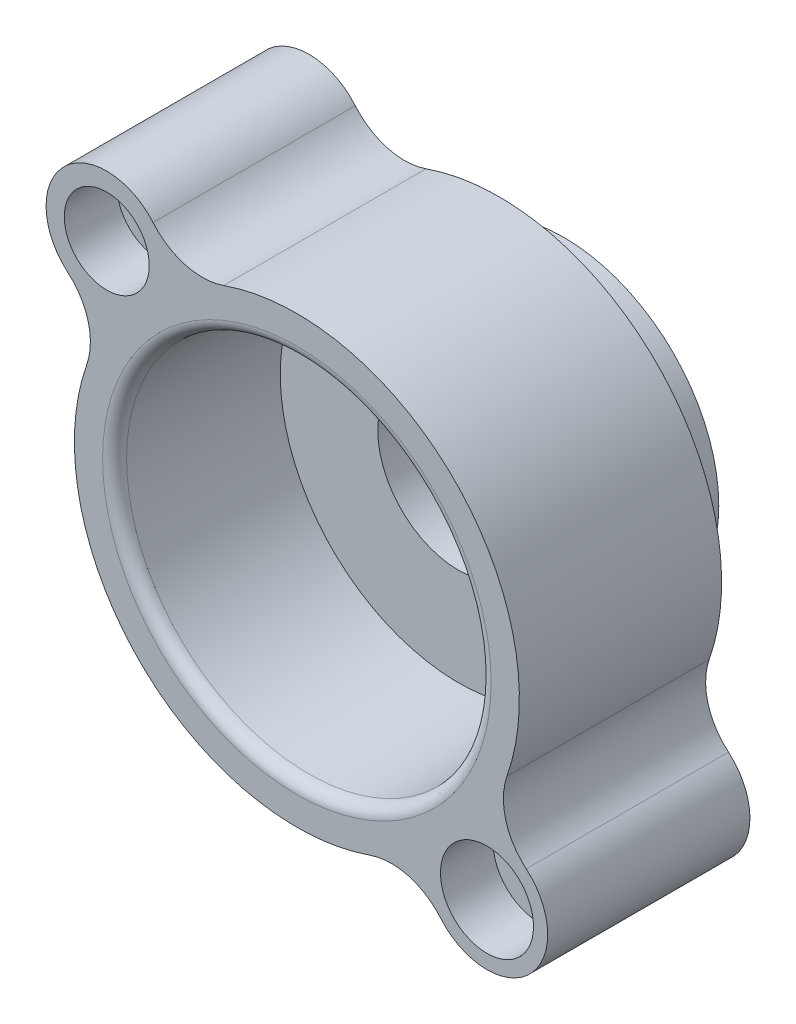
ISO-10303-21;
HEADER;
FILE_DESCRIPTION(('STEP AP214'),'2;1');
FILE_NAME('part.step','',(''),(''),'','','');
FILE_SCHEMA(('AUTOMOTIVE_DESIGN { 1 0 10303 214 1 1 1 1 }'));
ENDSEC;
DATA;
#1=APPLICATION_CONTEXT('core data for automotive mechanical design processes');
#2=APPLICATION_PROTOCOL_DEFINITION('international standard','automotive_design',2000,#1);
#3=PRODUCT_CONTEXT('',#1,'mechanical');
#4=PRODUCT('Part','Part','',(#3));
#5=PRODUCT_RELATED_PRODUCT_CATEGORY('part','',(#4));
#6=PRODUCT_DEFINITION_FORMATION('','',#4);
#7=PRODUCT_DEFINITION_CONTEXT('part definition',#1,'design');
#8=PRODUCT_DEFINITION('design','',#6,#7);
#9=PRODUCT_DEFINITION_SHAPE('','',#8);
#10=(LENGTH_UNIT() NAMED_UNIT(*) SI_UNIT(.MILLI.,.METRE.));
#11=(NAMED_UNIT(*) PLANE_ANGLE_UNIT() SI_UNIT($,.RADIAN.));
#12=(NAMED_UNIT(*) SI_UNIT($,.STERADIAN.) SOLID_ANGLE_UNIT());
#13=UNCERTAINTY_MEASURE_WITH_UNIT(LENGTH_MEASURE(1.E-05),#10,'distance_accuracy_value','');
#14=(GEOMETRIC_REPRESENTATION_CONTEXT(3) GLOBAL_UNCERTAINTY_ASSIGNED_CONTEXT((#13)) GLOBAL_UNIT_ASSIGNED_CONTEXT((#10,
#11,#12)) REPRESENTATION_CONTEXT('',''));
#15=CARTESIAN_POINT('',(0.,0.,0.));
#16=DIRECTION('',(0.,0.,1.));
#17=DIRECTION('',(1.,0.,0.));
#18=AXIS2_PLACEMENT_3D('',#15,#16,#17);
#19=CARTESIAN_POINT('',(-724.208508460082,446.758512816513,203.2));
#20=DIRECTION('',(0.,0.,1.));
#21=DIRECTION('',(1.,0.,0.));
#22=AXIS2_PLACEMENT_3D('',#19,#20,#21);
#23=PLANE('',#22);
#24=CARTESIAN_POINT('',(596.9,-596.9,203.2));
#25=DIRECTION('',(0.,0.,1.));
#26=DIRECTION('',(1.,0.,0.));
#27=AXIS2_PLACEMENT_3D('',#24,#25,#26);
#28=CIRCLE('',#27,69.85);
#29=CARTESIAN_POINT('',(666.75,-596.9,203.2));
#30=VERTEX_POINT('',#29);
#31=EDGE_CURVE('E176',#30,#30,#28,.T.);
#32=ORIENTED_EDGE('',*,*,#31,.T.);
#33=EDGE_LOOP('',(#32));
#34=FACE_BOUND('',#33,.T.);
#35=CARTESIAN_POINT('',(-596.9,596.9,203.2));
#36=DIRECTION('',(0.,0.,1.));
#37=DIRECTION('',(1.,0.,0.));
#38=AXIS2_PLACEMENT_3D('',#35,#36,#37);
#39=CIRCLE('',#38,69.85);
#40=CARTESIAN_POINT('',(-527.05,596.9,203.2));
#41=VERTEX_POINT('',#40);
#42=EDGE_CURVE('E171',#41,#41,#39,.T.);
#43=ORIENTED_EDGE('',*,*,#42,.T.);
#44=EDGE_LOOP('',(#43));
#45=FACE_BOUND('',#44,.T.);
#46=CARTESIAN_POINT('',(-596.9,596.9,203.2));
#47=DIRECTION('',(0.,0.,1.));
#48=DIRECTION('',(1.,0.,0.));
#49=AXIS2_PLACEMENT_3D('',#46,#47,#48);
#50=CIRCLE('',#49,190.5);
#51=CARTESIAN_POINT('',(-451.601786596628,720.101782380728,203.2));
#52=VERTEX_POINT('',#51);
#53=CARTESIAN_POINT('',(-720.101782380725,451.601786596626,203.2));
#54=VERTEX_POINT('',#53);
#55=EDGE_CURVE('E157',#52,#54,#50,.T.);
#56=ORIENTED_EDGE('',*,*,#55,.F.);
#57=CARTESIAN_POINT('',(-296.617025633027,851.517016920165,203.2));
#58=DIRECTION('',(0.,0.,-1.));
#59=DIRECTION('',(-1.,0.,0.));
#60=AXIS2_PLACEMENT_3D('',#57,#58,#59);
#61=CIRCLE('',#60,203.2);
#62=CARTESIAN_POINT('',(-229.773752250937,659.625858177592,203.2));
#63=VERTEX_POINT('',#62);
#64=EDGE_CURVE('E125',#63,#52,#61,.T.);
#65=ORIENTED_EDGE('',*,*,#64,.F.);
#66=CARTESIAN_POINT('',(0.,0.,203.2));
#67=DIRECTION('',(0.,0.,1.));
#68=DIRECTION('',(1.,0.,0.));
#69=AXIS2_PLACEMENT_3D('',#66,#67,#68);
#70=CIRCLE('',#69,698.5);
#71=CARTESIAN_POINT('',(659.625858177592,-229.773752250936,203.2));
#72=VERTEX_POINT('',#71);
#73=EDGE_CURVE('E110',#72,#63,#70,.T.);
#74=ORIENTED_EDGE('',*,*,#73,.F.);
#75=CARTESIAN_POINT('',(851.517016920165,-296.617025633027,203.2));
#76=DIRECTION('',(0.,0.,-1.));
#77=DIRECTION('',(-1.,0.,0.));
#78=AXIS2_PLACEMENT_3D('',#75,#76,#77);
#79=CIRCLE('',#78,203.2);
#80=CARTESIAN_POINT('',(720.101782380725,-451.601786596626,203.2));
#81=VERTEX_POINT('',#80);
#82=EDGE_CURVE('E123',#81,#72,#79,.T.);
#83=ORIENTED_EDGE('',*,*,#82,.F.);
#84=CARTESIAN_POINT('',(596.9,-596.9,203.2));
#85=DIRECTION('',(0.,0.,1.));
#86=DIRECTION('',(1.,0.,0.));
#87=AXIS2_PLACEMENT_3D('',#84,#85,#86);
#88=CIRCLE('',#87,190.5);
#89=CARTESIAN_POINT('',(451.601786596626,-720.101782380725,203.2));
#90=VERTEX_POINT('',#89);
#91=EDGE_CURVE('E128',#90,#81,#88,.T.);
#92=ORIENTED_EDGE('',*,*,#91,.F.);
#93=CARTESIAN_POINT('',(296.617025633027,-851.517016920165,203.2));
#94=DIRECTION('',(0.,0.,-1.));
#95=DIRECTION('',(-1.,0.,0.));
#96=AXIS2_PLACEMENT_3D('',#93,#94,#95);
#97=CIRCLE('',#96,203.2);
#98=CARTESIAN_POINT('',(229.773752250936,-659.625858177593,203.2));
#99=VERTEX_POINT('',#98);
#100=EDGE_CURVE('E130',#99,#90,#97,.T.);
#101=ORIENTED_EDGE('',*,*,#100,.F.);
#102=CARTESIAN_POINT('',(0.,0.,203.2));
#103=DIRECTION('',(0.,0.,1.));
#104=DIRECTION('',(1.,0.,0.));
#105=AXIS2_PLACEMENT_3D('',#102,#103,#104);
#106=CIRCLE('',#105,698.5);
#107=CARTESIAN_POINT('',(-659.625858177592,229.773752250936,203.2));
#108=VERTEX_POINT('',#107);
#109=EDGE_CURVE('E239',#108,#99,#106,.T.);
#110=ORIENTED_EDGE('',*,*,#109,.F.);
#111=CARTESIAN_POINT('',(-851.517016920165,296.617025633026,203.2));
#112=DIRECTION('',(0.,0.,-1.));
#113=DIRECTION('',(-1.,0.,0.));
#114=AXIS2_PLACEMENT_3D('',#111,#112,#113);
#115=CIRCLE('',#114,203.2);
#116=EDGE_CURVE('E237',#54,#108,#115,.T.);
#117=ORIENTED_EDGE('',*,*,#116,.F.);
#118=EDGE_LOOP('',(#56,#65,#74,#83,#92,#101,#110,#117));
#119=FACE_BOUND('',#118,.T.);
#120=CARTESIAN_POINT('',(0.,0.,203.2));
#121=DIRECTION('',(0.,0.,1.));
#122=DIRECTION('',(1.,0.,0.));
#123=AXIS2_PLACEMENT_3D('',#120,#121,#122);
#124=CIRCLE('',#123,486.41);
#125=CARTESIAN_POINT('',(486.41,0.,203.2));
#126=VERTEX_POINT('',#125);
#127=EDGE_CURVE('E159',#126,#126,#124,.F.);
#128=ORIENTED_EDGE('',*,*,#127,.F.);
#129=EDGE_LOOP('',(#128));
#130=FACE_BOUND('',#129,.T.);
#131=ADVANCED_FACE('F35',(#34,#45,#119,#130),#23,.F.);
#132=CARTESIAN_POINT('',(-596.9,596.9,203.2));
#133=DIRECTION('',(0.,0.,1.));
#134=DIRECTION('',(1.,0.,0.));
#135=AXIS2_PLACEMENT_3D('',#132,#133,#134);
#136=CYLINDRICAL_SURFACE('',#135,190.5);
#137=CARTESIAN_POINT('',(-596.9,596.9,838.2));
#138=DIRECTION('',(0.,0.,1.));
#139=DIRECTION('',(1.,0.,0.));
#140=AXIS2_PLACEMENT_3D('',#137,#138,#139);
#141=CIRCLE('',#140,190.5);
#142=CARTESIAN_POINT('',(-451.601786596628,720.101782380728,838.2));
#143=VERTEX_POINT('',#142);
#144=CARTESIAN_POINT('',(-720.101782380725,451.601786596626,838.2));
#145=VERTEX_POINT('',#144);
#146=EDGE_CURVE('E135',#143,#145,#141,.T.);
#147=ORIENTED_EDGE('',*,*,#146,.F.);
#148=DIRECTION('',(0.,0.,1.));
#149=VECTOR('',#148,1.);
#150=CARTESIAN_POINT('',(-451.601786596628,720.101782380728,203.2));
#151=LINE('',#150,#149);
#152=EDGE_CURVE('E52',#52,#143,#151,.T.);
#153=ORIENTED_EDGE('',*,*,#152,.F.);
#154=ORIENTED_EDGE('',*,*,#55,.T.);
#155=DIRECTION('',(0.,0.,1.));
#156=VECTOR('',#155,1.);
#157=CARTESIAN_POINT('',(-720.101782380725,451.601786596626,203.2));
#158=LINE('',#157,#156);
#159=EDGE_CURVE('E93',#54,#145,#158,.T.);
#160=ORIENTED_EDGE('',*,*,#159,.T.);
#161=EDGE_LOOP('',(#147,#153,#154,#160));
#162=FACE_BOUND('',#161,.T.);
#163=ADVANCED_FACE('F197',(#162),#136,.T.);
#164=CARTESIAN_POINT('',(-296.617025633027,851.517016920165,203.2));
#165=DIRECTION('',(0.,0.,1.));
#166=DIRECTION('',(1.,0.,0.));
#167=AXIS2_PLACEMENT_3D('',#164,#165,#166);
#168=CYLINDRICAL_SURFACE('',#167,203.2);
#169=CARTESIAN_POINT('',(-296.617025633027,851.517016920165,838.2));
#170=DIRECTION('',(0.,0.,-1.));
#171=DIRECTION('',(-1.,0.,0.));
#172=AXIS2_PLACEMENT_3D('',#169,#170,#171);
#173=CIRCLE('',#172,203.2);
#174=CARTESIAN_POINT('',(-229.773752250937,659.625858177592,838.2));
#175=VERTEX_POINT('',#174);
#176=EDGE_CURVE('E154',#175,#143,#173,.T.);
#177=ORIENTED_EDGE('',*,*,#176,.F.);
#178=DIRECTION('',(0.,0.,1.));
#179=VECTOR('',#178,1.);
#180=CARTESIAN_POINT('',(-229.773752250937,659.625858177592,203.2));
#181=LINE('',#180,#179);
#182=EDGE_CURVE('E81',#63,#175,#181,.T.);
#183=ORIENTED_EDGE('',*,*,#182,.F.);
#184=ORIENTED_EDGE('',*,*,#64,.T.);
#185=ORIENTED_EDGE('',*,*,#152,.T.);
#186=EDGE_LOOP('',(#177,#183,#184,#185));
#187=FACE_BOUND('',#186,.T.);
#188=ADVANCED_FACE('F203',(#187),#168,.F.);
#189=CARTESIAN_POINT('',(0.,0.,203.2));
#190=DIRECTION('',(0.,0.,1.));
#191=DIRECTION('',(1.,0.,0.));
#192=AXIS2_PLACEMENT_3D('',#189,#190,#191);
#193=CYLINDRICAL_SURFACE('',#192,698.5);
#194=CARTESIAN_POINT('',(0.,0.,838.2));
#195=DIRECTION('',(0.,0.,1.));
#196=DIRECTION('',(1.,0.,0.));
#197=AXIS2_PLACEMENT_3D('',#194,#195,#196);
#198=CIRCLE('',#197,698.5);
#199=CARTESIAN_POINT('',(659.625858177592,-229.773752250936,838.2));
#200=VERTEX_POINT('',#199);
#201=EDGE_CURVE('E112',#200,#175,#198,.T.);
#202=ORIENTED_EDGE('',*,*,#201,.F.);
#203=DIRECTION('',(0.,0.,1.));
#204=VECTOR('',#203,1.);
#205=CARTESIAN_POINT('',(659.625858177592,-229.773752250936,203.2));
#206=LINE('',#205,#204);
#207=EDGE_CURVE('E107',#72,#200,#206,.T.);
#208=ORIENTED_EDGE('',*,*,#207,.F.);
#209=ORIENTED_EDGE('',*,*,#73,.T.);
#210=ORIENTED_EDGE('',*,*,#182,.T.);
#211=EDGE_LOOP('',(#202,#208,#209,#210));
#212=FACE_BOUND('',#211,.T.);
#213=ADVANCED_FACE('F109',(#212),#193,.T.);
#214=CARTESIAN_POINT('',(851.517016920165,-296.617025633027,203.2));
#215=DIRECTION('',(0.,0.,1.));
#216=DIRECTION('',(1.,0.,0.));
#217=AXIS2_PLACEMENT_3D('',#214,#215,#216);
#218=CYLINDRICAL_SURFACE('',#217,203.2);
#219=CARTESIAN_POINT('',(851.517016920165,-296.617025633027,838.2));
#220=DIRECTION('',(0.,0.,-1.));
#221=DIRECTION('',(-1.,0.,0.));
#222=AXIS2_PLACEMENT_3D('',#219,#220,#221);
#223=CIRCLE('',#222,203.2);
#224=CARTESIAN_POINT('',(720.101782380725,-451.601786596626,838.2));
#225=VERTEX_POINT('',#224);
#226=EDGE_CURVE('E151',#225,#200,#223,.T.);
#227=ORIENTED_EDGE('',*,*,#226,.F.);
#228=DIRECTION('',(0.,0.,1.));
#229=VECTOR('',#228,1.);
#230=CARTESIAN_POINT('',(720.101782380725,-451.601786596626,203.2));
#231=LINE('',#230,#229);
#232=EDGE_CURVE('E117',#81,#225,#231,.T.);
#233=ORIENTED_EDGE('',*,*,#232,.F.);
#234=ORIENTED_EDGE('',*,*,#82,.T.);
#235=ORIENTED_EDGE('',*,*,#207,.T.);
#236=EDGE_LOOP('',(#227,#233,#234,#235));
#237=FACE_BOUND('',#236,.T.);
#238=ADVANCED_FACE('F127',(#237),#218,.F.);
#239=CARTESIAN_POINT('',(596.9,-596.9,203.2));
#240=DIRECTION('',(0.,0.,1.));
#241=DIRECTION('',(1.,0.,0.));
#242=AXIS2_PLACEMENT_3D('',#239,#240,#241);
#243=CYLINDRICAL_SURFACE('',#242,190.5);
#244=CARTESIAN_POINT('',(596.9,-596.9,838.2));
#245=DIRECTION('',(0.,0.,1.));
#246=DIRECTION('',(1.,0.,0.));
#247=AXIS2_PLACEMENT_3D('',#244,#245,#246);
#248=CIRCLE('',#247,190.5);
#249=CARTESIAN_POINT('',(451.601786596626,-720.101782380725,838.2));
#250=VERTEX_POINT('',#249);
#251=EDGE_CURVE('E148',#250,#225,#248,.T.);
#252=ORIENTED_EDGE('',*,*,#251,.F.);
#253=DIRECTION('',(0.,0.,1.));
#254=VECTOR('',#253,1.);
#255=CARTESIAN_POINT('',(451.601786596626,-720.101782380725,203.2));
#256=LINE('',#255,#254);
#257=EDGE_CURVE('E162',#90,#250,#256,.T.);
#258=ORIENTED_EDGE('',*,*,#257,.F.);
#259=ORIENTED_EDGE('',*,*,#91,.T.);
#260=ORIENTED_EDGE('',*,*,#232,.T.);
#261=EDGE_LOOP('',(#252,#258,#259,#260));
#262=FACE_BOUND('',#261,.T.);
#263=ADVANCED_FACE('F220',(#262),#243,.T.);
#264=CARTESIAN_POINT('',(296.617025633027,-851.517016920165,203.2));
#265=DIRECTION('',(0.,0.,1.));
#266=DIRECTION('',(1.,0.,0.));
#267=AXIS2_PLACEMENT_3D('',#264,#265,#266);
#268=CYLINDRICAL_SURFACE('',#267,203.2);
#269=CARTESIAN_POINT('',(296.617025633027,-851.517016920165,838.2));
#270=DIRECTION('',(0.,0.,-1.));
#271=DIRECTION('',(-1.,0.,0.));
#272=AXIS2_PLACEMENT_3D('',#269,#270,#271);
#273=CIRCLE('',#272,203.2);
#274=CARTESIAN_POINT('',(229.773752250936,-659.625858177593,838.2));
#275=VERTEX_POINT('',#274);
#276=EDGE_CURVE('E145',#275,#250,#273,.T.);
#277=ORIENTED_EDGE('',*,*,#276,.F.);
#278=DIRECTION('',(0.,0.,1.));
#279=VECTOR('',#278,1.);
#280=CARTESIAN_POINT('',(229.773752250936,-659.625858177593,203.2));
#281=LINE('',#280,#279);
#282=EDGE_CURVE('E164',#99,#275,#281,.T.);
#283=ORIENTED_EDGE('',*,*,#282,.F.);
#284=ORIENTED_EDGE('',*,*,#100,.T.);
#285=ORIENTED_EDGE('',*,*,#257,.T.);
#286=EDGE_LOOP('',(#277,#283,#284,#285));
#287=FACE_BOUND('',#286,.T.);
#288=ADVANCED_FACE('F223',(#287),#268,.F.);
#289=CARTESIAN_POINT('',(0.,0.,203.2));
#290=DIRECTION('',(0.,0.,1.));
#291=DIRECTION('',(1.,0.,0.));
#292=AXIS2_PLACEMENT_3D('',#289,#290,#291);
#293=CYLINDRICAL_SURFACE('',#292,698.5);
#294=CARTESIAN_POINT('',(0.,0.,838.2));
#295=DIRECTION('',(0.,0.,1.));
#296=DIRECTION('',(1.,0.,0.));
#297=AXIS2_PLACEMENT_3D('',#294,#295,#296);
#298=CIRCLE('',#297,698.5);
#299=CARTESIAN_POINT('',(-659.625858177592,229.773752250936,838.2));
#300=VERTEX_POINT('',#299);
#301=EDGE_CURVE('E142',#300,#275,#298,.T.);
#302=ORIENTED_EDGE('',*,*,#301,.F.);
#303=DIRECTION('',(0.,0.,1.));
#304=VECTOR('',#303,1.);
#305=CARTESIAN_POINT('',(-659.625858177592,229.773752250936,203.2));
#306=LINE('',#305,#304);
#307=EDGE_CURVE('E166',#108,#300,#306,.T.);
#308=ORIENTED_EDGE('',*,*,#307,.F.);
#309=ORIENTED_EDGE('',*,*,#109,.T.);
#310=ORIENTED_EDGE('',*,*,#282,.T.);
#311=EDGE_LOOP('',(#302,#308,#309,#310));
#312=FACE_BOUND('',#311,.T.);
#313=ADVANCED_FACE('F227',(#312),#293,.T.);
#314=CARTESIAN_POINT('',(-851.517016920165,296.617025633026,203.2));
#315=DIRECTION('',(0.,0.,1.));
#316=DIRECTION('',(1.,0.,0.));
#317=AXIS2_PLACEMENT_3D('',#314,#315,#316);
#318=CYLINDRICAL_SURFACE('',#317,203.2);
#319=CARTESIAN_POINT('',(-851.517016920165,296.617025633026,838.2));
#320=DIRECTION('',(0.,0.,-1.));
#321=DIRECTION('',(-1.,0.,0.));
#322=AXIS2_PLACEMENT_3D('',#319,#320,#321);
#323=CIRCLE('',#322,203.2);
#324=EDGE_CURVE('E138',#145,#300,#323,.T.);
#325=ORIENTED_EDGE('',*,*,#324,.F.);
#326=ORIENTED_EDGE('',*,*,#159,.F.);
#327=ORIENTED_EDGE('',*,*,#116,.T.);
#328=ORIENTED_EDGE('',*,*,#307,.T.);
#329=EDGE_LOOP('',(#325,#326,#327,#328));
#330=FACE_BOUND('',#329,.T.);
#331=ADVANCED_FACE('F212',(#330),#318,.F.);
#332=CARTESIAN_POINT('',(-724.208508460082,446.758512816513,838.2));
#333=DIRECTION('',(0.,0.,1.));
#334=DIRECTION('',(1.,0.,0.));
#335=AXIS2_PLACEMENT_3D('',#332,#333,#334);
#336=PLANE('',#335);
#337=CARTESIAN_POINT('',(0.,0.,838.2));
#338=DIRECTION('',(0.,0.,1.));
#339=DIRECTION('',(1.,0.,0.));
#340=AXIS2_PLACEMENT_3D('',#337,#338,#339);
#341=CIRCLE('',#340,609.929404390229);
#342=CARTESIAN_POINT('',(609.929404390229,0.,838.2));
#343=VERTEX_POINT('',#342);
#344=EDGE_CURVE('E11',#343,#343,#341,.F.);
#345=ORIENTED_EDGE('',*,*,#344,.T.);
#346=EDGE_LOOP('',(#345));
#347=FACE_BOUND('',#346,.T.);
#348=CARTESIAN_POINT('',(596.9,-596.9,838.2));
#349=DIRECTION('',(0.,0.,1.));
#350=DIRECTION('',(1.,0.,0.));
#351=AXIS2_PLACEMENT_3D('',#348,#349,#350);
#352=CIRCLE('',#351,146.05);
#353=CARTESIAN_POINT('',(742.95,-596.9,838.2));
#354=VERTEX_POINT('',#353);
#355=EDGE_CURVE('E271',#354,#354,#352,.T.);
#356=ORIENTED_EDGE('',*,*,#355,.F.);
#357=EDGE_LOOP('',(#356));
#358=FACE_BOUND('',#357,.T.);
#359=CARTESIAN_POINT('',(-596.9,596.9,838.2));
#360=DIRECTION('',(0.,0.,1.));
#361=DIRECTION('',(1.,0.,0.));
#362=AXIS2_PLACEMENT_3D('',#359,#360,#361);
#363=CIRCLE('',#362,133.35);
#364=CARTESIAN_POINT('',(-463.55,596.9,838.2));
#365=VERTEX_POINT('',#364);
#366=EDGE_CURVE('E178',#365,#365,#363,.T.);
#367=ORIENTED_EDGE('',*,*,#366,.F.);
#368=EDGE_LOOP('',(#367));
#369=FACE_BOUND('',#368,.T.);
#370=ORIENTED_EDGE('',*,*,#146,.T.);
#371=ORIENTED_EDGE('',*,*,#324,.T.);
#372=ORIENTED_EDGE('',*,*,#301,.T.);
#373=ORIENTED_EDGE('',*,*,#276,.T.);
#374=ORIENTED_EDGE('',*,*,#251,.T.);
#375=ORIENTED_EDGE('',*,*,#226,.T.);
#376=ORIENTED_EDGE('',*,*,#201,.T.);
#377=ORIENTED_EDGE('',*,*,#176,.T.);
#378=EDGE_LOOP('',(#370,#371,#372,#373,#374,#375,#376,#377));
#379=FACE_BOUND('',#378,.T.);
#380=ADVANCED_FACE('F209',(#347,#358,#369,#379),#336,.T.);
#381=CARTESIAN_POINT('',(0.,0.,0.));
#382=DIRECTION('',(0.,0.,1.));
#383=DIRECTION('',(1.,0.,0.));
#384=AXIS2_PLACEMENT_3D('',#381,#382,#383);
#385=CYLINDRICAL_SURFACE('',#384,486.41);
#386=CARTESIAN_POINT('',(0.,0.,0.));
#387=DIRECTION('',(0.,0.,-1.));
#388=DIRECTION('',(-1.,0.,0.));
#389=AXIS2_PLACEMENT_3D('',#386,#387,#388);
#390=CIRCLE('',#389,486.41);
#391=CARTESIAN_POINT('',(-486.41,0.,0.));
#392=VERTEX_POINT('',#391);
#393=EDGE_CURVE('E139',#392,#392,#390,.T.);
#394=ORIENTED_EDGE('',*,*,#393,.F.);
#395=EDGE_LOOP('',(#394));
#396=FACE_BOUND('',#395,.T.);
#397=ORIENTED_EDGE('',*,*,#127,.T.);
#398=EDGE_LOOP('',(#397));
#399=FACE_BOUND('',#398,.T.);
#400=ADVANCED_FACE('F207',(#396,#399),#385,.T.);
#401=CARTESIAN_POINT('',(0.,0.,0.));
#402=DIRECTION('',(0.,0.,-1.));
#403=DIRECTION('',(-1.,0.,0.));
#404=AXIS2_PLACEMENT_3D('',#401,#402,#403);
#405=PLANE('',#404);
#406=CARTESIAN_POINT('',(0.,0.,0.));
#407=DIRECTION('',(0.,0.,1.));
#408=DIRECTION('',(-1.,0.,0.));
#409=AXIS2_PLACEMENT_3D('',#406,#407,#408);
#410=CIRCLE('',#409,254.);
#411=CARTESIAN_POINT('',(-254.,0.,0.));
#412=VERTEX_POINT('',#411);
#413=EDGE_CURVE('E254',#412,#412,#410,.T.);
#414=ORIENTED_EDGE('',*,*,#413,.T.);
#415=EDGE_LOOP('',(#414));
#416=FACE_BOUND('',#415,.T.);
#417=ORIENTED_EDGE('',*,*,#393,.T.);
#418=EDGE_LOOP('',(#417));
#419=FACE_BOUND('',#418,.T.);
#420=ADVANCED_FACE('F309',(#416,#419),#405,.T.);
#421=CARTESIAN_POINT('',(0.,0.,838.2));
#422=DIRECTION('',(0.,0.,1.));
#423=DIRECTION('',(-1.,0.,0.));
#424=AXIS2_PLACEMENT_3D('',#421,#422,#423);
#425=CONICAL_SURFACE('',#424,572.769999999999,0.0249947936189154);
#426=CARTESIAN_POINT('',(0.,0.,801.052202483203));
#427=DIRECTION('',(0.,0.,1.));
#428=DIRECTION('',(1.,0.,0.));
#429=AXIS2_PLACEMENT_3D('',#426,#427,#428);
#430=CIRCLE('',#429,571.84130506208);
#431=CARTESIAN_POINT('',(571.84130506208,0.,801.052202483203));
#432=VERTEX_POINT('',#431);
#433=EDGE_CURVE('E44',#432,#432,#430,.T.);
#434=ORIENTED_EDGE('',*,*,#433,.T.);
#435=EDGE_LOOP('',(#434));
#436=FACE_BOUND('',#435,.T.);
#437=CARTESIAN_POINT('',(0.,0.,330.200000000001));
#438=DIRECTION('',(0.,0.,-1.));
#439=DIRECTION('',(-1.,0.,0.));
#440=AXIS2_PLACEMENT_3D('',#437,#438,#439);
#441=CIRCLE('',#440,560.070000000002);
#442=CARTESIAN_POINT('',(-560.070000000002,0.,330.200000000001));
#443=VERTEX_POINT('',#442);
#444=EDGE_CURVE('E251',#443,#443,#441,.F.);
#445=ORIENTED_EDGE('',*,*,#444,.F.);
#446=EDGE_LOOP('',(#445));
#447=FACE_BOUND('',#446,.T.);
#448=ADVANCED_FACE('F183',(#436,#447),#425,.F.);
#449=CARTESIAN_POINT('',(0.,0.,330.200000000001));
#450=DIRECTION('',(0.,0.,-1.));
#451=DIRECTION('',(-1.,0.,0.));
#452=AXIS2_PLACEMENT_3D('',#449,#450,#451);
#453=PLANE('',#452);
#454=CARTESIAN_POINT('',(0.,0.,330.200000000001));
#455=DIRECTION('',(0.,0.,1.));
#456=DIRECTION('',(-1.,0.,0.));
#457=AXIS2_PLACEMENT_3D('',#454,#455,#456);
#458=CIRCLE('',#457,254.);
#459=CARTESIAN_POINT('',(-254.,0.,330.200000000001));
#460=VERTEX_POINT('',#459);
#461=EDGE_CURVE('E174',#460,#460,#458,.T.);
#462=ORIENTED_EDGE('',*,*,#461,.F.);
#463=EDGE_LOOP('',(#462));
#464=FACE_BOUND('',#463,.T.);
#465=ORIENTED_EDGE('',*,*,#444,.T.);
#466=EDGE_LOOP('',(#465));
#467=FACE_BOUND('',#466,.T.);
#468=ADVANCED_FACE('F303',(#464,#467),#453,.F.);
#469=CARTESIAN_POINT('',(0.,0.,0.));
#470=DIRECTION('',(0.,0.,1.));
#471=DIRECTION('',(1.,0.,0.));
#472=AXIS2_PLACEMENT_3D('',#469,#470,#471);
#473=CYLINDRICAL_SURFACE('',#472,254.);
#474=ORIENTED_EDGE('',*,*,#413,.F.);
#475=EDGE_LOOP('',(#474));
#476=FACE_BOUND('',#475,.T.);
#477=ORIENTED_EDGE('',*,*,#461,.T.);
#478=EDGE_LOOP('',(#477));
#479=FACE_BOUND('',#478,.T.);
#480=ADVANCED_FACE('F299',(#476,#479),#473,.F.);
#481=CARTESIAN_POINT('',(-596.9,596.9,838.2));
#482=DIRECTION('',(0.,0.,1.));
#483=DIRECTION('',(1.,0.,0.));
#484=AXIS2_PLACEMENT_3D('',#481,#482,#483);
#485=CYLINDRICAL_SURFACE('',#484,69.85);
#486=CARTESIAN_POINT('',(-596.9,596.9,673.1));
#487=DIRECTION('',(0.,0.,1.));
#488=DIRECTION('',(1.,0.,0.));
#489=AXIS2_PLACEMENT_3D('',#486,#487,#488);
#490=CIRCLE('',#489,69.85);
#491=CARTESIAN_POINT('',(-527.05,596.9,673.1));
#492=VERTEX_POINT('',#491);
#493=EDGE_CURVE('E175',#492,#492,#490,.T.);
#494=ORIENTED_EDGE('',*,*,#493,.T.);
#495=EDGE_LOOP('',(#494));
#496=FACE_BOUND('',#495,.T.);
#497=ORIENTED_EDGE('',*,*,#42,.F.);
#498=EDGE_LOOP('',(#497));
#499=FACE_BOUND('',#498,.T.);
#500=ADVANCED_FACE('F291',(#496,#499),#485,.F.);
#501=CARTESIAN_POINT('',(-527.05,596.9,673.1));
#502=DIRECTION('',(0.,0.,-1.));
#503=DIRECTION('',(-1.,0.,0.));
#504=AXIS2_PLACEMENT_3D('',#501,#502,#503);
#505=PLANE('',#504);
#506=ORIENTED_EDGE('',*,*,#493,.F.);
#507=EDGE_LOOP('',(#506));
#508=FACE_BOUND('',#507,.T.);
#509=CARTESIAN_POINT('',(-596.9,596.9,673.1));
#510=DIRECTION('',(0.,0.,1.));
#511=DIRECTION('',(1.,0.,0.));
#512=AXIS2_PLACEMENT_3D('',#509,#510,#511);
#513=CIRCLE('',#512,133.35);
#514=CARTESIAN_POINT('',(-463.55,596.9,673.1));
#515=VERTEX_POINT('',#514);
#516=EDGE_CURVE('E261',#515,#515,#513,.T.);
#517=ORIENTED_EDGE('',*,*,#516,.T.);
#518=EDGE_LOOP('',(#517));
#519=FACE_BOUND('',#518,.T.);
#520=ADVANCED_FACE('F282',(#508,#519),#505,.F.);
#521=CARTESIAN_POINT('',(-596.9,596.9,838.2));
#522=DIRECTION('',(0.,0.,1.));
#523=DIRECTION('',(1.,0.,0.));
#524=AXIS2_PLACEMENT_3D('',#521,#522,#523);
#525=CYLINDRICAL_SURFACE('',#524,133.35);
#526=ORIENTED_EDGE('',*,*,#516,.F.);
#527=EDGE_LOOP('',(#526));
#528=FACE_BOUND('',#527,.T.);
#529=ORIENTED_EDGE('',*,*,#366,.T.);
#530=EDGE_LOOP('',(#529));
#531=FACE_BOUND('',#530,.T.);
#532=ADVANCED_FACE('F279',(#528,#531),#525,.F.);
#533=CARTESIAN_POINT('',(596.9,-596.9,838.2));
#534=DIRECTION('',(0.,0.,1.));
#535=DIRECTION('',(1.,0.,0.));
#536=AXIS2_PLACEMENT_3D('',#533,#534,#535);
#537=CYLINDRICAL_SURFACE('',#536,69.85);
#538=CARTESIAN_POINT('',(596.9,-596.9,673.1));
#539=DIRECTION('',(0.,0.,1.));
#540=DIRECTION('',(1.,0.,0.));
#541=AXIS2_PLACEMENT_3D('',#538,#539,#540);
#542=CIRCLE('',#541,69.85);
#543=CARTESIAN_POINT('',(666.75,-596.9,673.1));
#544=VERTEX_POINT('',#543);
#545=EDGE_CURVE('E179',#544,#544,#542,.T.);
#546=ORIENTED_EDGE('',*,*,#545,.T.);
#547=EDGE_LOOP('',(#546));
#548=FACE_BOUND('',#547,.T.);
#549=ORIENTED_EDGE('',*,*,#31,.F.);
#550=EDGE_LOOP('',(#549));
#551=FACE_BOUND('',#550,.T.);
#552=ADVANCED_FACE('F281',(#548,#551),#537,.F.);
#553=CARTESIAN_POINT('',(666.75,-596.9,673.1));
#554=DIRECTION('',(0.,0.,-1.));
#555=DIRECTION('',(-1.,0.,0.));
#556=AXIS2_PLACEMENT_3D('',#553,#554,#555);
#557=PLANE('',#556);
#558=ORIENTED_EDGE('',*,*,#545,.F.);
#559=EDGE_LOOP('',(#558));
#560=FACE_BOUND('',#559,.T.);
#561=CARTESIAN_POINT('',(596.9,-596.9,673.1));
#562=DIRECTION('',(0.,0.,1.));
#563=DIRECTION('',(1.,0.,0.));
#564=AXIS2_PLACEMENT_3D('',#561,#562,#563);
#565=CIRCLE('',#564,146.05);
#566=CARTESIAN_POINT('',(742.95,-596.9,673.1));
#567=VERTEX_POINT('',#566);
#568=EDGE_CURVE('E268',#567,#567,#565,.T.);
#569=ORIENTED_EDGE('',*,*,#568,.T.);
#570=EDGE_LOOP('',(#569));
#571=FACE_BOUND('',#570,.T.);
#572=ADVANCED_FACE('F192',(#560,#571),#557,.F.);
#573=CARTESIAN_POINT('',(596.9,-596.9,838.2));
#574=DIRECTION('',(0.,0.,1.));
#575=DIRECTION('',(1.,0.,0.));
#576=AXIS2_PLACEMENT_3D('',#573,#574,#575);
#577=CYLINDRICAL_SURFACE('',#576,146.05);
#578=ORIENTED_EDGE('',*,*,#568,.F.);
#579=EDGE_LOOP('',(#578));
#580=FACE_BOUND('',#579,.T.);
#581=ORIENTED_EDGE('',*,*,#355,.T.);
#582=EDGE_LOOP('',(#581));
#583=FACE_BOUND('',#582,.T.);
#584=ADVANCED_FACE('F187',(#580,#583),#577,.F.);
#585=CARTESIAN_POINT('',(0.,0.,800.1));
#586=DIRECTION('',(0.,0.,1.));
#587=DIRECTION('',(1.,0.,0.));
#588=AXIS2_PLACEMENT_3D('',#585,#586,#587);
#589=TOROIDAL_SURFACE('',#588,609.929404390229,38.1);
#590=ORIENTED_EDGE('',*,*,#344,.F.);
#591=EDGE_LOOP('',(#590));
#592=FACE_BOUND('',#591,.T.);
#593=ORIENTED_EDGE('',*,*,#433,.F.);
#594=EDGE_LOOP('',(#593));
#595=FACE_BOUND('',#594,.T.);
#596=ADVANCED_FACE('F37',(#592,#595),#589,.T.);
#597=CLOSED_SHELL('',(#131,#163,#188,#213,#238,#263,#288,#313,#331,#380,#400,#420,#448,#468,
#480,#500,#520,#532,#552,#572,#584,#596));
#598=MANIFOLD_SOLID_BREP('B2',#597);
#599=ADVANCED_BREP_SHAPE_REPRESENTATION('',(#18,#598),#14);
#600=SHAPE_DEFINITION_REPRESENTATION(#9,#599);
ENDSEC;
END-ISO-10303-21;
